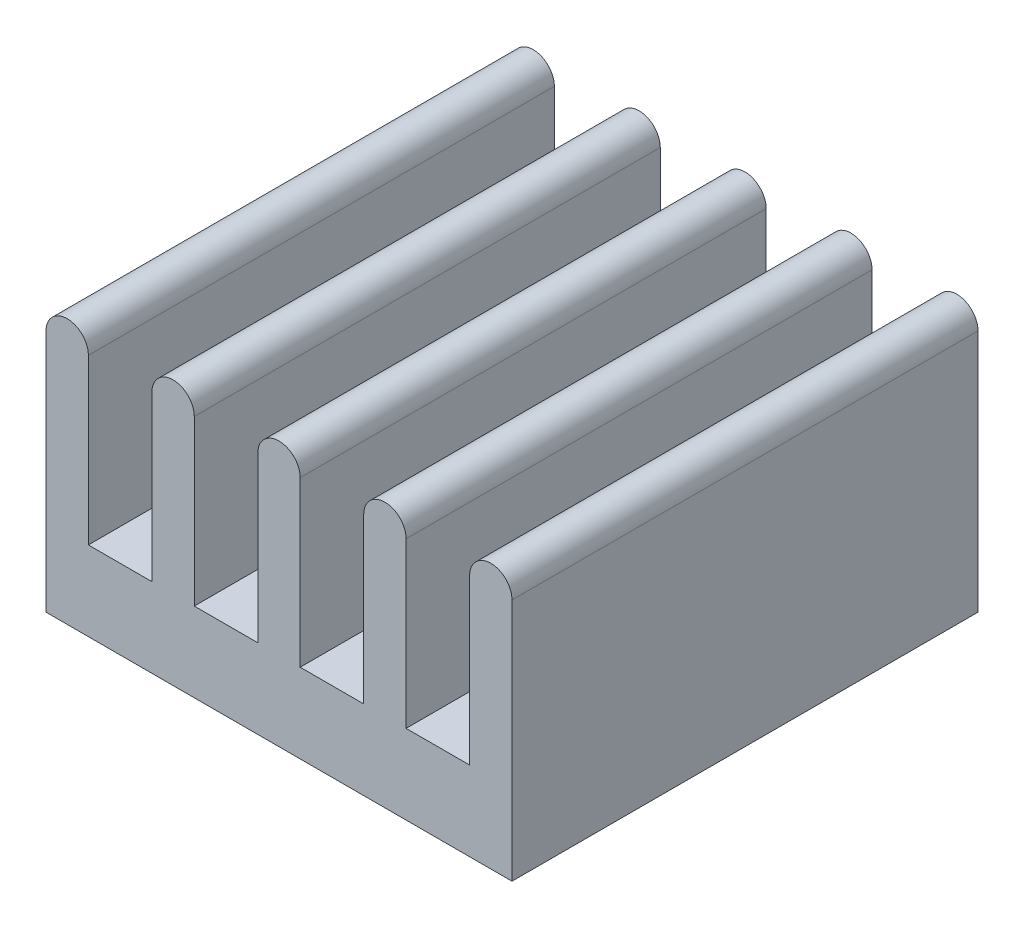
ISO-10303-21;
HEADER;
FILE_DESCRIPTION(('STEP AP214'),'2;1');
FILE_NAME('part.step','',(''),(''),'','','');
FILE_SCHEMA(('AUTOMOTIVE_DESIGN { 1 0 10303 214 1 1 1 1 }'));
ENDSEC;
DATA;
#1=APPLICATION_CONTEXT('core data for automotive mechanical design processes');
#2=APPLICATION_PROTOCOL_DEFINITION('international standard','automotive_design',2000,#1);
#3=PRODUCT_CONTEXT('',#1,'mechanical');
#4=PRODUCT('Part','Part','',(#3));
#5=PRODUCT_RELATED_PRODUCT_CATEGORY('part','',(#4));
#6=PRODUCT_DEFINITION_FORMATION('','',#4);
#7=PRODUCT_DEFINITION_CONTEXT('part definition',#1,'design');
#8=PRODUCT_DEFINITION('design','',#6,#7);
#9=PRODUCT_DEFINITION_SHAPE('','',#8);
#10=(LENGTH_UNIT() NAMED_UNIT(*) SI_UNIT(.MILLI.,.METRE.));
#11=(NAMED_UNIT(*) PLANE_ANGLE_UNIT() SI_UNIT($,.RADIAN.));
#12=(NAMED_UNIT(*) SI_UNIT($,.STERADIAN.) SOLID_ANGLE_UNIT());
#13=UNCERTAINTY_MEASURE_WITH_UNIT(LENGTH_MEASURE(1.E-05),#10,'distance_accuracy_value','');
#14=(GEOMETRIC_REPRESENTATION_CONTEXT(3) GLOBAL_UNCERTAINTY_ASSIGNED_CONTEXT((#13)) GLOBAL_UNIT_ASSIGNED_CONTEXT((#10,
#11,#12)) REPRESENTATION_CONTEXT('',''));
#15=CARTESIAN_POINT('',(0.,0.,0.));
#16=DIRECTION('',(0.,0.,1.));
#17=DIRECTION('',(1.,0.,0.));
#18=AXIS2_PLACEMENT_3D('',#15,#16,#17);
#19=CARTESIAN_POINT('',(19.6500000000062,-3.94999999998325,4.90000000003319));
#20=DIRECTION('',(0.,0.,1.));
#21=DIRECTION('',(1.,0.,0.));
#22=AXIS2_PLACEMENT_3D('',#19,#20,#21);
#23=PLANE('',#22);
#24=CARTESIAN_POINT('',(11.2500000000062,-1.84999999998325,4.90000000003319));
#25=DIRECTION('',(0.,0.,1.));
#26=DIRECTION('',(-1.,0.,0.));
#27=AXIS2_PLACEMENT_3D('',#24,#25,#26);
#28=CIRCLE('',#27,0.4);
#29=CARTESIAN_POINT('',(11.6500000000062,-1.84999999998325,4.90000000003319));
#30=VERTEX_POINT('',#29);
#31=CARTESIAN_POINT('',(10.8500000000062,-1.84999999998325,4.90000000003319));
#32=VERTEX_POINT('',#31);
#33=EDGE_CURVE('E11',#30,#32,#28,.T.);
#34=ORIENTED_EDGE('',*,*,#33,.T.);
#35=DIRECTION('',(0.,-1.,0.));
#36=VECTOR('',#35,1.);
#37=CARTESIAN_POINT('',(10.8500000000062,-1.84999999998325,4.90000000003319));
#38=LINE('',#37,#36);
#39=CARTESIAN_POINT('',(10.8500000000062,-6.44999999998325,4.90000000003319));
#40=VERTEX_POINT('',#39);
#41=EDGE_CURVE('E28',#32,#40,#38,.T.);
#42=ORIENTED_EDGE('',*,*,#41,.T.);
#43=DIRECTION('',(1.,0.,0.));
#44=VECTOR('',#43,1.);
#45=CARTESIAN_POINT('',(10.8500000000062,-6.44999999998325,4.90000000003319));
#46=LINE('',#45,#44);
#47=CARTESIAN_POINT('',(19.6500000000062,-6.44999999998326,4.90000000003319));
#48=VERTEX_POINT('',#47);
#49=EDGE_CURVE('E270',#40,#48,#46,.T.);
#50=ORIENTED_EDGE('',*,*,#49,.T.);
#51=DIRECTION('',(0.,1.,0.));
#52=VECTOR('',#51,1.);
#53=CARTESIAN_POINT('',(19.6500000000062,-6.44999999998326,4.90000000003319));
#54=LINE('',#53,#52);
#55=CARTESIAN_POINT('',(19.6500000000062,-1.84999999998325,4.90000000003319));
#56=VERTEX_POINT('',#55);
#57=EDGE_CURVE('E211',#48,#56,#54,.T.);
#58=ORIENTED_EDGE('',*,*,#57,.T.);
#59=CARTESIAN_POINT('',(19.2500000000062,-1.84999999998325,4.90000000003319));
#60=DIRECTION('',(0.,0.,1.));
#61=DIRECTION('',(-1.,0.,0.));
#62=AXIS2_PLACEMENT_3D('',#59,#60,#61);
#63=CIRCLE('',#62,0.4);
#64=CARTESIAN_POINT('',(18.8500000000062,-1.84999999998325,4.90000000003319));
#65=VERTEX_POINT('',#64);
#66=EDGE_CURVE('E266',#56,#65,#63,.T.);
#67=ORIENTED_EDGE('',*,*,#66,.T.);
#68=DIRECTION('',(0.,-1.,0.));
#69=VECTOR('',#68,1.);
#70=CARTESIAN_POINT('',(18.8500000000062,-1.84999999998325,4.90000000003319));
#71=LINE('',#70,#69);
#72=CARTESIAN_POINT('',(18.8500000000062,-4.94999999998324,4.90000000003319));
#73=VERTEX_POINT('',#72);
#74=EDGE_CURVE('E260',#65,#73,#71,.T.);
#75=ORIENTED_EDGE('',*,*,#74,.T.);
#76=DIRECTION('',(-1.,0.,0.));
#77=VECTOR('',#76,1.);
#78=CARTESIAN_POINT('',(18.8500000000062,-4.94999999998324,4.90000000003319));
#79=LINE('',#78,#77);
#80=CARTESIAN_POINT('',(17.6500000000062,-4.94999999998325,4.90000000003319));
#81=VERTEX_POINT('',#80);
#82=EDGE_CURVE('E256',#73,#81,#79,.T.);
#83=ORIENTED_EDGE('',*,*,#82,.T.);
#84=DIRECTION('',(0.,1.,0.));
#85=VECTOR('',#84,1.);
#86=CARTESIAN_POINT('',(17.6500000000062,-4.94999999998325,4.90000000003319));
#87=LINE('',#86,#85);
#88=CARTESIAN_POINT('',(17.6500000000062,-1.84999999998325,4.90000000003319));
#89=VERTEX_POINT('',#88);
#90=EDGE_CURVE('E234',#81,#89,#87,.T.);
#91=ORIENTED_EDGE('',*,*,#90,.T.);
#92=CARTESIAN_POINT('',(17.2500000000062,-1.84999999998325,4.90000000003319));
#93=DIRECTION('',(0.,0.,1.));
#94=DIRECTION('',(-1.,0.,0.));
#95=AXIS2_PLACEMENT_3D('',#92,#93,#94);
#96=CIRCLE('',#95,0.4);
#97=CARTESIAN_POINT('',(16.8500000000062,-1.84999999998325,4.90000000003319));
#98=VERTEX_POINT('',#97);
#99=EDGE_CURVE('E231',#89,#98,#96,.T.);
#100=ORIENTED_EDGE('',*,*,#99,.T.);
#101=DIRECTION('',(0.,-1.,0.));
#102=VECTOR('',#101,1.);
#103=CARTESIAN_POINT('',(16.8500000000062,-1.84999999998325,4.90000000003319));
#104=LINE('',#103,#102);
#105=CARTESIAN_POINT('',(16.8500000000062,-4.94999999998324,4.90000000003319));
#106=VERTEX_POINT('',#105);
#107=EDGE_CURVE('E235',#98,#106,#104,.T.);
#108=ORIENTED_EDGE('',*,*,#107,.T.);
#109=DIRECTION('',(-1.,0.,0.));
#110=VECTOR('',#109,1.);
#111=CARTESIAN_POINT('',(16.8500000000062,-4.94999999998325,4.90000000003319));
#112=LINE('',#111,#110);
#113=CARTESIAN_POINT('',(15.6500000000062,-4.94999999998325,4.90000000003319));
#114=VERTEX_POINT('',#113);
#115=EDGE_CURVE('E261',#106,#114,#112,.T.);
#116=ORIENTED_EDGE('',*,*,#115,.T.);
#117=DIRECTION('',(0.,1.,0.));
#118=VECTOR('',#117,1.);
#119=CARTESIAN_POINT('',(15.6500000000062,-4.94999999998325,4.90000000003319));
#120=LINE('',#119,#118);
#121=CARTESIAN_POINT('',(15.6500000000062,-1.84999999998325,4.90000000003319));
#122=VERTEX_POINT('',#121);
#123=EDGE_CURVE('E265',#114,#122,#120,.T.);
#124=ORIENTED_EDGE('',*,*,#123,.T.);
#125=CARTESIAN_POINT('',(15.2500000000062,-1.84999999998325,4.90000000003319));
#126=DIRECTION('',(0.,0.,1.));
#127=DIRECTION('',(-1.,0.,0.));
#128=AXIS2_PLACEMENT_3D('',#125,#126,#127);
#129=CIRCLE('',#128,0.4);
#130=CARTESIAN_POINT('',(14.8500000000062,-1.84999999998325,4.90000000003319));
#131=VERTEX_POINT('',#130);
#132=EDGE_CURVE('E252',#122,#131,#129,.T.);
#133=ORIENTED_EDGE('',*,*,#132,.T.);
#134=DIRECTION('',(0.,-1.,0.));
#135=VECTOR('',#134,1.);
#136=CARTESIAN_POINT('',(14.8500000000062,-1.84999999998325,4.90000000003319));
#137=LINE('',#136,#135);
#138=CARTESIAN_POINT('',(14.8500000000062,-4.94999999998325,4.90000000003319));
#139=VERTEX_POINT('',#138);
#140=EDGE_CURVE('E248',#131,#139,#137,.T.);
#141=ORIENTED_EDGE('',*,*,#140,.T.);
#142=DIRECTION('',(-1.,0.,0.));
#143=VECTOR('',#142,1.);
#144=CARTESIAN_POINT('',(14.8500000000062,-4.94999999998325,4.90000000003319));
#145=LINE('',#144,#143);
#146=CARTESIAN_POINT('',(13.6500000000062,-4.94999999998325,4.90000000003319));
#147=VERTEX_POINT('',#146);
#148=EDGE_CURVE('E253',#139,#147,#145,.T.);
#149=ORIENTED_EDGE('',*,*,#148,.T.);
#150=DIRECTION('',(0.,1.,0.));
#151=VECTOR('',#150,1.);
#152=CARTESIAN_POINT('',(13.6500000000062,-4.94999999998325,4.90000000003319));
#153=LINE('',#152,#151);
#154=CARTESIAN_POINT('',(13.6500000000062,-1.84999999998325,4.90000000003319));
#155=VERTEX_POINT('',#154);
#156=EDGE_CURVE('E246',#147,#155,#153,.T.);
#157=ORIENTED_EDGE('',*,*,#156,.T.);
#158=CARTESIAN_POINT('',(13.2500000000062,-1.84999999998325,4.90000000003319));
#159=DIRECTION('',(0.,0.,1.));
#160=DIRECTION('',(-1.,0.,0.));
#161=AXIS2_PLACEMENT_3D('',#158,#159,#160);
#162=CIRCLE('',#161,0.4);
#163=CARTESIAN_POINT('',(12.8500000000062,-1.84999999998325,4.90000000003319));
#164=VERTEX_POINT('',#163);
#165=EDGE_CURVE('E242',#155,#164,#162,.T.);
#166=ORIENTED_EDGE('',*,*,#165,.T.);
#167=DIRECTION('',(0.,-1.,0.));
#168=VECTOR('',#167,1.);
#169=CARTESIAN_POINT('',(12.8500000000062,-1.84999999998325,4.90000000003319));
#170=LINE('',#169,#168);
#171=CARTESIAN_POINT('',(12.8500000000062,-4.94999999998326,4.90000000003319));
#172=VERTEX_POINT('',#171);
#173=EDGE_CURVE('E247',#164,#172,#170,.T.);
#174=ORIENTED_EDGE('',*,*,#173,.T.);
#175=DIRECTION('',(-1.,0.,0.));
#176=VECTOR('',#175,1.);
#177=CARTESIAN_POINT('',(12.8500000000062,-4.94999999998326,4.90000000003319));
#178=LINE('',#177,#176);
#179=CARTESIAN_POINT('',(11.6500000000062,-4.94999999998325,4.90000000003319));
#180=VERTEX_POINT('',#179);
#181=EDGE_CURVE('E335',#172,#180,#178,.T.);
#182=ORIENTED_EDGE('',*,*,#181,.T.);
#183=DIRECTION('',(0.,1.,0.));
#184=VECTOR('',#183,1.);
#185=CARTESIAN_POINT('',(11.6500000000062,-4.94999999998325,4.90000000003319));
#186=LINE('',#185,#184);
#187=EDGE_CURVE('E147',#180,#30,#186,.T.);
#188=ORIENTED_EDGE('',*,*,#187,.T.);
#189=EDGE_LOOP('',(#34,#42,#50,#58,#67,#75,#83,#91,#100,#108,#116,#124,#133,#141,#149,#157,#166,
#174,#182,#188));
#190=FACE_BOUND('',#189,.T.);
#191=ADVANCED_FACE('F17',(#190),#23,.T.);
#192=CARTESIAN_POINT('',(11.2500000000062,-1.84999999998325,0.500000000033185));
#193=DIRECTION('',(0.,0.,1.));
#194=DIRECTION('',(1.,0.,0.));
#195=AXIS2_PLACEMENT_3D('',#192,#193,#194);
#196=CYLINDRICAL_SURFACE('',#195,0.4);
#197=CARTESIAN_POINT('',(11.2500000000062,-1.84999999998325,-3.89999999996682));
#198=DIRECTION('',(0.,0.,1.));
#199=DIRECTION('',(-1.,0.,0.));
#200=AXIS2_PLACEMENT_3D('',#197,#198,#199);
#201=CIRCLE('',#200,0.4);
#202=CARTESIAN_POINT('',(11.6500000000062,-1.84999999998325,-3.89999999996682));
#203=VERTEX_POINT('',#202);
#204=CARTESIAN_POINT('',(10.8500000000062,-1.84999999998325,-3.89999999996682));
#205=VERTEX_POINT('',#204);
#206=EDGE_CURVE('E222',#203,#205,#201,.T.);
#207=ORIENTED_EDGE('',*,*,#206,.T.);
#208=DIRECTION('',(0.,0.,-1.));
#209=VECTOR('',#208,1.);
#210=CARTESIAN_POINT('',(10.8500000000062,-1.84999999998325,4.90000000003319));
#211=LINE('',#210,#209);
#212=EDGE_CURVE('E336',#32,#205,#211,.T.);
#213=ORIENTED_EDGE('',*,*,#212,.F.);
#214=ORIENTED_EDGE('',*,*,#33,.F.);
#215=DIRECTION('',(0.,0.,-1.));
#216=VECTOR('',#215,1.);
#217=CARTESIAN_POINT('',(11.6500000000062,-1.84999999998325,4.90000000003319));
#218=LINE('',#217,#216);
#219=EDGE_CURVE('E226',#30,#203,#218,.T.);
#220=ORIENTED_EDGE('',*,*,#219,.T.);
#221=EDGE_LOOP('',(#207,#213,#214,#220));
#222=FACE_BOUND('',#221,.T.);
#223=ADVANCED_FACE('F405',(#222),#196,.T.);
#224=CARTESIAN_POINT('',(15.2500000000062,-6.44999999998326,-3.89999999996683));
#225=DIRECTION('',(0.,0.,-1.));
#226=DIRECTION('',(0.,-1.,0.));
#227=AXIS2_PLACEMENT_3D('',#224,#225,#226);
#228=PLANE('',#227);
#229=ORIENTED_EDGE('',*,*,#206,.F.);
#230=DIRECTION('',(0.,1.,0.));
#231=VECTOR('',#230,1.);
#232=CARTESIAN_POINT('',(11.6500000000062,-4.94999999998325,-3.89999999996682));
#233=LINE('',#232,#231);
#234=CARTESIAN_POINT('',(11.6500000000062,-4.94999999998324,-3.89999999996682));
#235=VERTEX_POINT('',#234);
#236=EDGE_CURVE('E311',#235,#203,#233,.T.);
#237=ORIENTED_EDGE('',*,*,#236,.F.);
#238=DIRECTION('',(-1.,0.,0.));
#239=VECTOR('',#238,1.);
#240=CARTESIAN_POINT('',(12.8500000000062,-4.94999999998326,-3.89999999996682));
#241=LINE('',#240,#239);
#242=CARTESIAN_POINT('',(12.8500000000062,-4.94999999998326,-3.89999999996682));
#243=VERTEX_POINT('',#242);
#244=EDGE_CURVE('E339',#243,#235,#241,.T.);
#245=ORIENTED_EDGE('',*,*,#244,.F.);
#246=DIRECTION('',(0.,-1.,0.));
#247=VECTOR('',#246,1.);
#248=CARTESIAN_POINT('',(12.8500000000062,-1.84999999998325,-3.89999999996682));
#249=LINE('',#248,#247);
#250=CARTESIAN_POINT('',(12.8500000000062,-1.84999999998325,-3.89999999996682));
#251=VERTEX_POINT('',#250);
#252=EDGE_CURVE('E331',#251,#243,#249,.T.);
#253=ORIENTED_EDGE('',*,*,#252,.F.);
#254=CARTESIAN_POINT('',(13.2500000000062,-1.84999999998325,-3.89999999996682));
#255=DIRECTION('',(0.,0.,1.));
#256=DIRECTION('',(-1.,0.,0.));
#257=AXIS2_PLACEMENT_3D('',#254,#255,#256);
#258=CIRCLE('',#257,0.4);
#259=CARTESIAN_POINT('',(13.6500000000062,-1.84999999998325,-3.89999999996682));
#260=VERTEX_POINT('',#259);
#261=EDGE_CURVE('E332',#260,#251,#258,.T.);
#262=ORIENTED_EDGE('',*,*,#261,.F.);
#263=DIRECTION('',(0.,1.,0.));
#264=VECTOR('',#263,1.);
#265=CARTESIAN_POINT('',(13.6500000000062,-4.94999999998325,-3.89999999996682));
#266=LINE('',#265,#264);
#267=CARTESIAN_POINT('',(13.6500000000062,-4.94999999998324,-3.89999999996682));
#268=VERTEX_POINT('',#267);
#269=EDGE_CURVE('E273',#268,#260,#266,.T.);
#270=ORIENTED_EDGE('',*,*,#269,.F.);
#271=DIRECTION('',(-1.,0.,0.));
#272=VECTOR('',#271,1.);
#273=CARTESIAN_POINT('',(14.8500000000062,-4.94999999998325,-3.89999999996682));
#274=LINE('',#273,#272);
#275=CARTESIAN_POINT('',(14.8500000000062,-4.94999999998324,-3.89999999996682));
#276=VERTEX_POINT('',#275);
#277=EDGE_CURVE('E282',#276,#268,#274,.T.);
#278=ORIENTED_EDGE('',*,*,#277,.F.);
#279=DIRECTION('',(0.,-1.,0.));
#280=VECTOR('',#279,1.);
#281=CARTESIAN_POINT('',(14.8500000000062,-1.84999999998325,-3.89999999996682));
#282=LINE('',#281,#280);
#283=CARTESIAN_POINT('',(14.8500000000062,-1.84999999998325,-3.89999999996682));
#284=VERTEX_POINT('',#283);
#285=EDGE_CURVE('E287',#284,#276,#282,.T.);
#286=ORIENTED_EDGE('',*,*,#285,.F.);
#287=CARTESIAN_POINT('',(15.2500000000062,-1.84999999998325,-3.89999999996682));
#288=DIRECTION('',(0.,0.,1.));
#289=DIRECTION('',(-1.,0.,0.));
#290=AXIS2_PLACEMENT_3D('',#287,#288,#289);
#291=CIRCLE('',#290,0.4);
#292=CARTESIAN_POINT('',(15.6500000000062,-1.84999999998325,-3.89999999996682));
#293=VERTEX_POINT('',#292);
#294=EDGE_CURVE('E241',#293,#284,#291,.T.);
#295=ORIENTED_EDGE('',*,*,#294,.F.);
#296=DIRECTION('',(0.,1.,0.));
#297=VECTOR('',#296,1.);
#298=CARTESIAN_POINT('',(15.6500000000062,-4.94999999998325,-3.89999999996682));
#299=LINE('',#298,#297);
#300=CARTESIAN_POINT('',(15.6500000000062,-4.94999999998324,-3.89999999996682));
#301=VERTEX_POINT('',#300);
#302=EDGE_CURVE('E21',#301,#293,#299,.T.);
#303=ORIENTED_EDGE('',*,*,#302,.F.);
#304=DIRECTION('',(-1.,0.,0.));
#305=VECTOR('',#304,1.);
#306=CARTESIAN_POINT('',(16.8500000000062,-4.94999999998324,-3.89999999996682));
#307=LINE('',#306,#305);
#308=CARTESIAN_POINT('',(16.8500000000062,-4.94999999998324,-3.89999999996682));
#309=VERTEX_POINT('',#308);
#310=EDGE_CURVE('E349',#309,#301,#307,.T.);
#311=ORIENTED_EDGE('',*,*,#310,.F.);
#312=DIRECTION('',(0.,-1.,0.));
#313=VECTOR('',#312,1.);
#314=CARTESIAN_POINT('',(16.8500000000062,-1.84999999998325,-3.89999999996682));
#315=LINE('',#314,#313);
#316=CARTESIAN_POINT('',(16.8500000000062,-1.84999999998325,-3.89999999996682));
#317=VERTEX_POINT('',#316);
#318=EDGE_CURVE('E307',#317,#309,#315,.T.);
#319=ORIENTED_EDGE('',*,*,#318,.F.);
#320=CARTESIAN_POINT('',(17.2500000000062,-1.84999999998325,-3.89999999996682));
#321=DIRECTION('',(0.,0.,1.));
#322=DIRECTION('',(-1.,0.,0.));
#323=AXIS2_PLACEMENT_3D('',#320,#321,#322);
#324=CIRCLE('',#323,0.4);
#325=CARTESIAN_POINT('',(17.6500000000062,-1.84999999998325,-3.89999999996682));
#326=VERTEX_POINT('',#325);
#327=EDGE_CURVE('E288',#326,#317,#324,.T.);
#328=ORIENTED_EDGE('',*,*,#327,.F.);
#329=DIRECTION('',(0.,1.,0.));
#330=VECTOR('',#329,1.);
#331=CARTESIAN_POINT('',(17.6500000000062,-4.94999999998325,-3.89999999996682));
#332=LINE('',#331,#330);
#333=CARTESIAN_POINT('',(17.6500000000062,-4.94999999998325,-3.89999999996682));
#334=VERTEX_POINT('',#333);
#335=EDGE_CURVE('E298',#334,#326,#332,.T.);
#336=ORIENTED_EDGE('',*,*,#335,.F.);
#337=DIRECTION('',(-1.,0.,0.));
#338=VECTOR('',#337,1.);
#339=CARTESIAN_POINT('',(18.8500000000062,-4.94999999998324,-3.89999999996682));
#340=LINE('',#339,#338);
#341=CARTESIAN_POINT('',(18.8500000000062,-4.94999999998324,-3.89999999996682));
#342=VERTEX_POINT('',#341);
#343=EDGE_CURVE('E360',#342,#334,#340,.T.);
#344=ORIENTED_EDGE('',*,*,#343,.F.);
#345=DIRECTION('',(0.,-1.,0.));
#346=VECTOR('',#345,1.);
#347=CARTESIAN_POINT('',(18.8500000000062,-1.84999999998325,-3.89999999996682));
#348=LINE('',#347,#346);
#349=CARTESIAN_POINT('',(18.8500000000062,-1.84999999998325,-3.89999999996682));
#350=VERTEX_POINT('',#349);
#351=EDGE_CURVE('E227',#350,#342,#348,.T.);
#352=ORIENTED_EDGE('',*,*,#351,.F.);
#353=CARTESIAN_POINT('',(19.2500000000062,-1.84999999998325,-3.89999999996682));
#354=DIRECTION('',(0.,0.,1.));
#355=DIRECTION('',(-1.,0.,0.));
#356=AXIS2_PLACEMENT_3D('',#353,#354,#355);
#357=CIRCLE('',#356,0.4);
#358=CARTESIAN_POINT('',(19.6500000000062,-1.84999999998325,-3.89999999996682));
#359=VERTEX_POINT('',#358);
#360=EDGE_CURVE('E202',#359,#350,#357,.T.);
#361=ORIENTED_EDGE('',*,*,#360,.F.);
#362=DIRECTION('',(0.,1.,0.));
#363=VECTOR('',#362,1.);
#364=CARTESIAN_POINT('',(19.6500000000062,-6.44999999998326,-3.89999999996682));
#365=LINE('',#364,#363);
#366=CARTESIAN_POINT('',(19.6500000000062,-6.44999999998326,-3.89999999996682));
#367=VERTEX_POINT('',#366);
#368=EDGE_CURVE('E198',#367,#359,#365,.T.);
#369=ORIENTED_EDGE('',*,*,#368,.F.);
#370=DIRECTION('',(1.,0.,0.));
#371=VECTOR('',#370,1.);
#372=CARTESIAN_POINT('',(10.8500000000062,-6.44999999998325,-3.89999999996682));
#373=LINE('',#372,#371);
#374=CARTESIAN_POINT('',(10.8500000000062,-6.44999999998324,-3.89999999996682));
#375=VERTEX_POINT('',#374);
#376=EDGE_CURVE('E188',#375,#367,#373,.T.);
#377=ORIENTED_EDGE('',*,*,#376,.F.);
#378=DIRECTION('',(0.,-1.,0.));
#379=VECTOR('',#378,1.);
#380=CARTESIAN_POINT('',(10.8500000000062,-1.84999999998325,-3.89999999996682));
#381=LINE('',#380,#379);
#382=EDGE_CURVE('E321',#205,#375,#381,.T.);
#383=ORIENTED_EDGE('',*,*,#382,.F.);
#384=EDGE_LOOP('',(#229,#237,#245,#253,#262,#270,#278,#286,#295,#303,#311,#319,#328,#336,#344,
#352,#361,#369,#377,#383));
#385=FACE_BOUND('',#384,.T.);
#386=ADVANCED_FACE('F200',(#385),#228,.T.);
#387=CARTESIAN_POINT('',(11.6500000000062,-4.94999999998325,0.500000000033185));
#388=DIRECTION('',(1.,0.,0.));
#389=DIRECTION('',(0.,1.,0.));
#390=AXIS2_PLACEMENT_3D('',#387,#388,#389);
#391=PLANE('',#390);
#392=ORIENTED_EDGE('',*,*,#236,.T.);
#393=ORIENTED_EDGE('',*,*,#219,.F.);
#394=ORIENTED_EDGE('',*,*,#187,.F.);
#395=DIRECTION('',(0.,0.,-1.));
#396=VECTOR('',#395,1.);
#397=CARTESIAN_POINT('',(11.6500000000062,-4.94999999998325,4.90000000003319));
#398=LINE('',#397,#396);
#399=EDGE_CURVE('E315',#180,#235,#398,.T.);
#400=ORIENTED_EDGE('',*,*,#399,.T.);
#401=EDGE_LOOP('',(#392,#393,#394,#400));
#402=FACE_BOUND('',#401,.T.);
#403=ADVANCED_FACE('F409',(#402),#391,.T.);
#404=CARTESIAN_POINT('',(12.8500000000062,-4.94999999998326,0.500000000033185));
#405=DIRECTION('',(0.,1.,0.));
#406=DIRECTION('',(1.,0.,0.));
#407=AXIS2_PLACEMENT_3D('',#404,#405,#406);
#408=PLANE('',#407);
#409=ORIENTED_EDGE('',*,*,#244,.T.);
#410=ORIENTED_EDGE('',*,*,#399,.F.);
#411=ORIENTED_EDGE('',*,*,#181,.F.);
#412=DIRECTION('',(0.,0.,-1.));
#413=VECTOR('',#412,1.);
#414=CARTESIAN_POINT('',(12.8500000000062,-4.94999999998326,4.90000000003319));
#415=LINE('',#414,#413);
#416=EDGE_CURVE('E342',#172,#243,#415,.T.);
#417=ORIENTED_EDGE('',*,*,#416,.T.);
#418=EDGE_LOOP('',(#409,#410,#411,#417));
#419=FACE_BOUND('',#418,.T.);
#420=ADVANCED_FACE('F505',(#419),#408,.T.);
#421=CARTESIAN_POINT('',(12.8500000000062,-1.84999999998325,0.500000000033185));
#422=DIRECTION('',(-1.,0.,0.));
#423=DIRECTION('',(0.,0.,1.));
#424=AXIS2_PLACEMENT_3D('',#421,#422,#423);
#425=PLANE('',#424);
#426=ORIENTED_EDGE('',*,*,#252,.T.);
#427=ORIENTED_EDGE('',*,*,#416,.F.);
#428=ORIENTED_EDGE('',*,*,#173,.F.);
#429=DIRECTION('',(0.,0.,-1.));
#430=VECTOR('',#429,1.);
#431=CARTESIAN_POINT('',(12.8500000000062,-1.84999999998325,4.90000000003319));
#432=LINE('',#431,#430);
#433=EDGE_CURVE('E327',#164,#251,#432,.T.);
#434=ORIENTED_EDGE('',*,*,#433,.T.);
#435=EDGE_LOOP('',(#426,#427,#428,#434));
#436=FACE_BOUND('',#435,.T.);
#437=ADVANCED_FACE('F501',(#436),#425,.T.);
#438=CARTESIAN_POINT('',(13.2500000000062,-1.84999999998325,0.500000000033185));
#439=DIRECTION('',(0.,0.,1.));
#440=DIRECTION('',(1.,0.,0.));
#441=AXIS2_PLACEMENT_3D('',#438,#439,#440);
#442=CYLINDRICAL_SURFACE('',#441,0.4);
#443=ORIENTED_EDGE('',*,*,#261,.T.);
#444=ORIENTED_EDGE('',*,*,#433,.F.);
#445=ORIENTED_EDGE('',*,*,#165,.F.);
#446=DIRECTION('',(0.,0.,-1.));
#447=VECTOR('',#446,1.);
#448=CARTESIAN_POINT('',(13.6500000000062,-1.84999999998325,4.90000000003319));
#449=LINE('',#448,#447);
#450=EDGE_CURVE('E276',#155,#260,#449,.T.);
#451=ORIENTED_EDGE('',*,*,#450,.T.);
#452=EDGE_LOOP('',(#443,#444,#445,#451));
#453=FACE_BOUND('',#452,.T.);
#454=ADVANCED_FACE('F504',(#453),#442,.T.);
#455=CARTESIAN_POINT('',(13.6500000000062,-4.94999999998325,0.500000000033185));
#456=DIRECTION('',(1.,0.,0.));
#457=DIRECTION('',(0.,1.,0.));
#458=AXIS2_PLACEMENT_3D('',#455,#456,#457);
#459=PLANE('',#458);
#460=ORIENTED_EDGE('',*,*,#269,.T.);
#461=ORIENTED_EDGE('',*,*,#450,.F.);
#462=ORIENTED_EDGE('',*,*,#156,.F.);
#463=DIRECTION('',(0.,0.,-1.));
#464=VECTOR('',#463,1.);
#465=CARTESIAN_POINT('',(13.6500000000062,-4.94999999998325,4.90000000003319));
#466=LINE('',#465,#464);
#467=EDGE_CURVE('E277',#147,#268,#466,.T.);
#468=ORIENTED_EDGE('',*,*,#467,.T.);
#469=EDGE_LOOP('',(#460,#461,#462,#468));
#470=FACE_BOUND('',#469,.T.);
#471=ADVANCED_FACE('F488',(#470),#459,.T.);
#472=CARTESIAN_POINT('',(14.8500000000062,-4.94999999998325,0.500000000033185));
#473=DIRECTION('',(0.,1.,0.));
#474=DIRECTION('',(1.,0.,0.));
#475=AXIS2_PLACEMENT_3D('',#472,#473,#474);
#476=PLANE('',#475);
#477=ORIENTED_EDGE('',*,*,#277,.T.);
#478=ORIENTED_EDGE('',*,*,#467,.F.);
#479=ORIENTED_EDGE('',*,*,#148,.F.);
#480=DIRECTION('',(0.,0.,-1.));
#481=VECTOR('',#480,1.);
#482=CARTESIAN_POINT('',(14.8500000000062,-4.94999999998325,4.90000000003319));
#483=LINE('',#482,#481);
#484=EDGE_CURVE('E318',#139,#276,#483,.T.);
#485=ORIENTED_EDGE('',*,*,#484,.T.);
#486=EDGE_LOOP('',(#477,#478,#479,#485));
#487=FACE_BOUND('',#486,.T.);
#488=ADVANCED_FACE('F496',(#487),#476,.T.);
#489=CARTESIAN_POINT('',(14.8500000000062,-1.84999999998325,0.500000000033185));
#490=DIRECTION('',(-1.,0.,0.));
#491=DIRECTION('',(0.,0.,1.));
#492=AXIS2_PLACEMENT_3D('',#489,#490,#491);
#493=PLANE('',#492);
#494=ORIENTED_EDGE('',*,*,#285,.T.);
#495=ORIENTED_EDGE('',*,*,#484,.F.);
#496=ORIENTED_EDGE('',*,*,#140,.F.);
#497=DIRECTION('',(0.,0.,-1.));
#498=VECTOR('',#497,1.);
#499=CARTESIAN_POINT('',(14.8500000000062,-1.84999999998325,4.90000000003319));
#500=LINE('',#499,#498);
#501=EDGE_CURVE('E283',#131,#284,#500,.T.);
#502=ORIENTED_EDGE('',*,*,#501,.T.);
#503=EDGE_LOOP('',(#494,#495,#496,#502));
#504=FACE_BOUND('',#503,.T.);
#505=ADVANCED_FACE('F499',(#504),#493,.T.);
#506=CARTESIAN_POINT('',(15.2500000000062,-1.84999999998325,0.500000000033185));
#507=DIRECTION('',(0.,0.,1.));
#508=DIRECTION('',(1.,0.,0.));
#509=AXIS2_PLACEMENT_3D('',#506,#507,#508);
#510=CYLINDRICAL_SURFACE('',#509,0.4);
#511=ORIENTED_EDGE('',*,*,#294,.T.);
#512=ORIENTED_EDGE('',*,*,#501,.F.);
#513=ORIENTED_EDGE('',*,*,#132,.F.);
#514=DIRECTION('',(0.,0.,-1.));
#515=VECTOR('',#514,1.);
#516=CARTESIAN_POINT('',(15.6500000000062,-1.84999999998325,4.90000000003319));
#517=LINE('',#516,#515);
#518=EDGE_CURVE('E237',#122,#293,#517,.T.);
#519=ORIENTED_EDGE('',*,*,#518,.T.);
#520=EDGE_LOOP('',(#511,#512,#513,#519));
#521=FACE_BOUND('',#520,.T.);
#522=ADVANCED_FACE('F468',(#521),#510,.T.);
#523=CARTESIAN_POINT('',(15.6500000000062,-4.94999999998325,0.500000000033185));
#524=DIRECTION('',(1.,0.,0.));
#525=DIRECTION('',(0.,1.,0.));
#526=AXIS2_PLACEMENT_3D('',#523,#524,#525);
#527=PLANE('',#526);
#528=ORIENTED_EDGE('',*,*,#302,.T.);
#529=ORIENTED_EDGE('',*,*,#518,.F.);
#530=ORIENTED_EDGE('',*,*,#123,.F.);
#531=DIRECTION('',(0.,0.,-1.));
#532=VECTOR('',#531,1.);
#533=CARTESIAN_POINT('',(15.6500000000062,-4.94999999998325,4.90000000003319));
#534=LINE('',#533,#532);
#535=EDGE_CURVE('E440',#114,#301,#534,.T.);
#536=ORIENTED_EDGE('',*,*,#535,.T.);
#537=EDGE_LOOP('',(#528,#529,#530,#536));
#538=FACE_BOUND('',#537,.T.);
#539=ADVANCED_FACE('F491',(#538),#527,.T.);
#540=CARTESIAN_POINT('',(16.8500000000062,-4.94999999998325,0.500000000033185));
#541=DIRECTION('',(0.,1.,0.));
#542=DIRECTION('',(1.,0.,0.));
#543=AXIS2_PLACEMENT_3D('',#540,#541,#542);
#544=PLANE('',#543);
#545=ORIENTED_EDGE('',*,*,#310,.T.);
#546=ORIENTED_EDGE('',*,*,#535,.F.);
#547=ORIENTED_EDGE('',*,*,#115,.F.);
#548=DIRECTION('',(0.,0.,-1.));
#549=VECTOR('',#548,1.);
#550=CARTESIAN_POINT('',(16.8500000000062,-4.94999999998325,4.90000000003319));
#551=LINE('',#550,#549);
#552=EDGE_CURVE('E310',#106,#309,#551,.T.);
#553=ORIENTED_EDGE('',*,*,#552,.T.);
#554=EDGE_LOOP('',(#545,#546,#547,#553));
#555=FACE_BOUND('',#554,.T.);
#556=ADVANCED_FACE('F489',(#555),#544,.T.);
#557=CARTESIAN_POINT('',(16.8500000000062,-1.84999999998325,0.500000000033185));
#558=DIRECTION('',(-1.,0.,0.));
#559=DIRECTION('',(0.,0.,1.));
#560=AXIS2_PLACEMENT_3D('',#557,#558,#559);
#561=PLANE('',#560);
#562=ORIENTED_EDGE('',*,*,#318,.T.);
#563=ORIENTED_EDGE('',*,*,#552,.F.);
#564=ORIENTED_EDGE('',*,*,#107,.F.);
#565=DIRECTION('',(0.,0.,-1.));
#566=VECTOR('',#565,1.);
#567=CARTESIAN_POINT('',(16.8500000000062,-1.84999999998325,4.90000000003319));
#568=LINE('',#567,#566);
#569=EDGE_CURVE('E291',#98,#317,#568,.T.);
#570=ORIENTED_EDGE('',*,*,#569,.T.);
#571=EDGE_LOOP('',(#562,#563,#564,#570));
#572=FACE_BOUND('',#571,.T.);
#573=ADVANCED_FACE('F484',(#572),#561,.T.);
#574=CARTESIAN_POINT('',(17.2500000000062,-1.84999999998325,0.500000000033185));
#575=DIRECTION('',(0.,0.,1.));
#576=DIRECTION('',(1.,0.,0.));
#577=AXIS2_PLACEMENT_3D('',#574,#575,#576);
#578=CYLINDRICAL_SURFACE('',#577,0.4);
#579=ORIENTED_EDGE('',*,*,#327,.T.);
#580=ORIENTED_EDGE('',*,*,#569,.F.);
#581=ORIENTED_EDGE('',*,*,#99,.F.);
#582=DIRECTION('',(0.,0.,-1.));
#583=VECTOR('',#582,1.);
#584=CARTESIAN_POINT('',(17.6500000000062,-1.84999999998325,4.90000000003319));
#585=LINE('',#584,#583);
#586=EDGE_CURVE('E292',#89,#326,#585,.T.);
#587=ORIENTED_EDGE('',*,*,#586,.T.);
#588=EDGE_LOOP('',(#579,#580,#581,#587));
#589=FACE_BOUND('',#588,.T.);
#590=ADVANCED_FACE('F478',(#589),#578,.T.);
#591=CARTESIAN_POINT('',(17.6500000000062,-4.94999999998326,0.500000000033185));
#592=DIRECTION('',(1.,0.,0.));
#593=DIRECTION('',(0.,1.,0.));
#594=AXIS2_PLACEMENT_3D('',#591,#592,#593);
#595=PLANE('',#594);
#596=ORIENTED_EDGE('',*,*,#335,.T.);
#597=ORIENTED_EDGE('',*,*,#586,.F.);
#598=ORIENTED_EDGE('',*,*,#90,.F.);
#599=DIRECTION('',(0.,0.,-1.));
#600=VECTOR('',#599,1.);
#601=CARTESIAN_POINT('',(17.6500000000062,-4.94999999998326,4.90000000003319));
#602=LINE('',#601,#600);
#603=EDGE_CURVE('E362',#81,#334,#602,.T.);
#604=ORIENTED_EDGE('',*,*,#603,.T.);
#605=EDGE_LOOP('',(#596,#597,#598,#604));
#606=FACE_BOUND('',#605,.T.);
#607=ADVANCED_FACE('F391',(#606),#595,.T.);
#608=CARTESIAN_POINT('',(18.8500000000062,-4.94999999998324,0.500000000033185));
#609=DIRECTION('',(0.,1.,0.));
#610=DIRECTION('',(1.,0.,0.));
#611=AXIS2_PLACEMENT_3D('',#608,#609,#610);
#612=PLANE('',#611);
#613=ORIENTED_EDGE('',*,*,#343,.T.);
#614=ORIENTED_EDGE('',*,*,#603,.F.);
#615=ORIENTED_EDGE('',*,*,#82,.F.);
#616=DIRECTION('',(0.,0.,-1.));
#617=VECTOR('',#616,1.);
#618=CARTESIAN_POINT('',(18.8500000000062,-4.94999999998324,4.90000000003319));
#619=LINE('',#618,#617);
#620=EDGE_CURVE('E220',#73,#342,#619,.T.);
#621=ORIENTED_EDGE('',*,*,#620,.T.);
#622=EDGE_LOOP('',(#613,#614,#615,#621));
#623=FACE_BOUND('',#622,.T.);
#624=ADVANCED_FACE('F377',(#623),#612,.T.);
#625=CARTESIAN_POINT('',(18.8500000000062,-1.84999999998325,0.500000000033185));
#626=DIRECTION('',(-1.,0.,0.));
#627=DIRECTION('',(0.,0.,1.));
#628=AXIS2_PLACEMENT_3D('',#625,#626,#627);
#629=PLANE('',#628);
#630=ORIENTED_EDGE('',*,*,#351,.T.);
#631=ORIENTED_EDGE('',*,*,#620,.F.);
#632=ORIENTED_EDGE('',*,*,#74,.F.);
#633=DIRECTION('',(0.,0.,-1.));
#634=VECTOR('',#633,1.);
#635=CARTESIAN_POINT('',(18.8500000000062,-1.84999999998325,4.90000000003319));
#636=LINE('',#635,#634);
#637=EDGE_CURVE('E230',#65,#350,#636,.T.);
#638=ORIENTED_EDGE('',*,*,#637,.T.);
#639=EDGE_LOOP('',(#630,#631,#632,#638));
#640=FACE_BOUND('',#639,.T.);
#641=ADVANCED_FACE('F380',(#640),#629,.T.);
#642=CARTESIAN_POINT('',(19.2500000000062,-1.84999999998325,0.500000000033185));
#643=DIRECTION('',(0.,0.,1.));
#644=DIRECTION('',(1.,0.,0.));
#645=AXIS2_PLACEMENT_3D('',#642,#643,#644);
#646=CYLINDRICAL_SURFACE('',#645,0.4);
#647=ORIENTED_EDGE('',*,*,#360,.T.);
#648=ORIENTED_EDGE('',*,*,#637,.F.);
#649=ORIENTED_EDGE('',*,*,#66,.F.);
#650=DIRECTION('',(0.,0.,-1.));
#651=VECTOR('',#650,1.);
#652=CARTESIAN_POINT('',(19.6500000000062,-1.84999999998325,4.90000000003319));
#653=LINE('',#652,#651);
#654=EDGE_CURVE('E207',#56,#359,#653,.T.);
#655=ORIENTED_EDGE('',*,*,#654,.T.);
#656=EDGE_LOOP('',(#647,#648,#649,#655));
#657=FACE_BOUND('',#656,.T.);
#658=ADVANCED_FACE('F476',(#657),#646,.T.);
#659=CARTESIAN_POINT('',(19.6500000000062,-6.44999999998326,0.500000000033185));
#660=DIRECTION('',(1.,0.,0.));
#661=DIRECTION('',(0.,1.,0.));
#662=AXIS2_PLACEMENT_3D('',#659,#660,#661);
#663=PLANE('',#662);
#664=ORIENTED_EDGE('',*,*,#368,.T.);
#665=ORIENTED_EDGE('',*,*,#654,.F.);
#666=ORIENTED_EDGE('',*,*,#57,.F.);
#667=DIRECTION('',(0.,0.,-1.));
#668=VECTOR('',#667,1.);
#669=CARTESIAN_POINT('',(19.6500000000062,-6.44999999998326,4.90000000003319));
#670=LINE('',#669,#668);
#671=EDGE_CURVE('E191',#48,#367,#670,.T.);
#672=ORIENTED_EDGE('',*,*,#671,.T.);
#673=EDGE_LOOP('',(#664,#665,#666,#672));
#674=FACE_BOUND('',#673,.T.);
#675=ADVANCED_FACE('F209',(#674),#663,.T.);
#676=CARTESIAN_POINT('',(10.8500000000062,-6.44999999998325,0.500000000033185));
#677=DIRECTION('',(0.,-1.,0.));
#678=DIRECTION('',(-1.,0.,0.));
#679=AXIS2_PLACEMENT_3D('',#676,#677,#678);
#680=PLANE('',#679);
#681=ORIENTED_EDGE('',*,*,#376,.T.);
#682=ORIENTED_EDGE('',*,*,#671,.F.);
#683=ORIENTED_EDGE('',*,*,#49,.F.);
#684=DIRECTION('',(0.,0.,-1.));
#685=VECTOR('',#684,1.);
#686=CARTESIAN_POINT('',(10.8500000000062,-6.44999999998325,4.90000000003319));
#687=LINE('',#686,#685);
#688=EDGE_CURVE('E192',#40,#375,#687,.T.);
#689=ORIENTED_EDGE('',*,*,#688,.T.);
#690=EDGE_LOOP('',(#681,#682,#683,#689));
#691=FACE_BOUND('',#690,.T.);
#692=ADVANCED_FACE('F19',(#691),#680,.T.);
#693=CARTESIAN_POINT('',(10.8500000000062,-1.84999999998325,0.500000000033185));
#694=DIRECTION('',(-1.,0.,0.));
#695=DIRECTION('',(0.,0.,1.));
#696=AXIS2_PLACEMENT_3D('',#693,#694,#695);
#697=PLANE('',#696);
#698=ORIENTED_EDGE('',*,*,#382,.T.);
#699=ORIENTED_EDGE('',*,*,#688,.F.);
#700=ORIENTED_EDGE('',*,*,#41,.F.);
#701=ORIENTED_EDGE('',*,*,#212,.T.);
#702=EDGE_LOOP('',(#698,#699,#700,#701));
#703=FACE_BOUND('',#702,.T.);
#704=ADVANCED_FACE('F450',(#703),#697,.T.);
#705=CLOSED_SHELL('',(#191,#223,#386,#403,#420,#437,#454,#471,#488,#505,#522,#539,#556,#573,
#590,#607,#624,#641,#658,#675,#692,#704));
#706=MANIFOLD_SOLID_BREP('B1',#705);
#707=ADVANCED_BREP_SHAPE_REPRESENTATION('',(#18,#706),#14);
#708=SHAPE_DEFINITION_REPRESENTATION(#9,#707);
ENDSEC;
END-ISO-10303-21;
